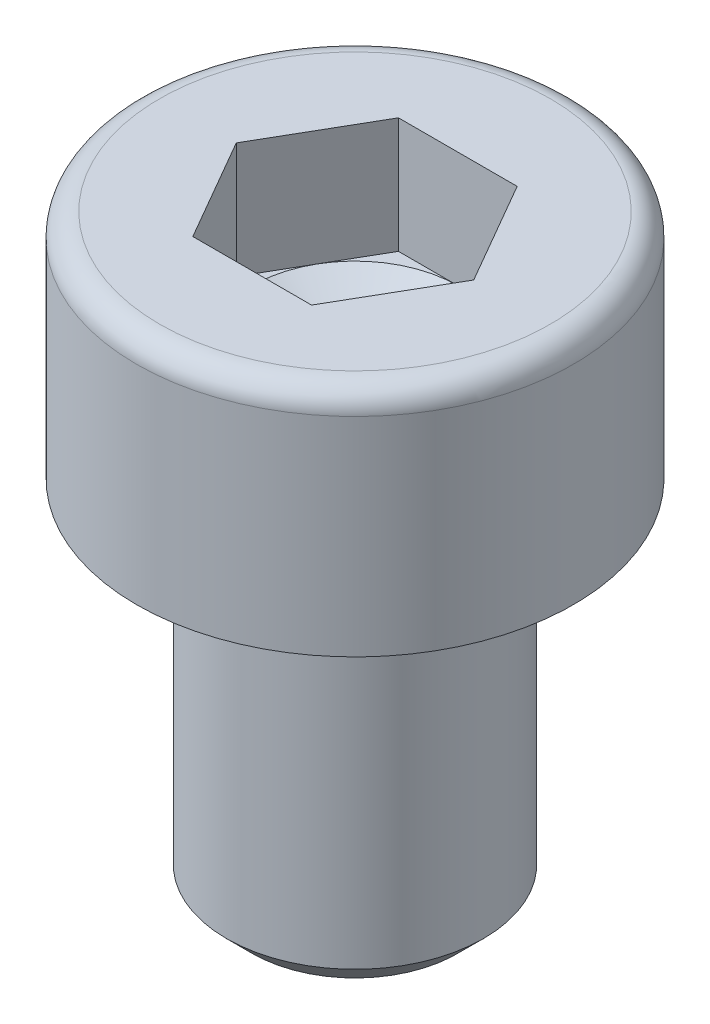
ISO-10303-21;
HEADER;
FILE_DESCRIPTION(('STEP AP214'),'2;1');
FILE_NAME('part.step','',(''),(''),'','','');
FILE_SCHEMA(('AUTOMOTIVE_DESIGN { 1 0 10303 214 1 1 1 1 }'));
ENDSEC;
DATA;
#1=APPLICATION_CONTEXT('core data for automotive mechanical design processes');
#2=APPLICATION_PROTOCOL_DEFINITION('international standard','automotive_design',2000,#1);
#3=PRODUCT_CONTEXT('',#1,'mechanical');
#4=PRODUCT('Part','Part','',(#3));
#5=PRODUCT_RELATED_PRODUCT_CATEGORY('part','',(#4));
#6=PRODUCT_DEFINITION_FORMATION('','',#4);
#7=PRODUCT_DEFINITION_CONTEXT('part definition',#1,'design');
#8=PRODUCT_DEFINITION('design','',#6,#7);
#9=PRODUCT_DEFINITION_SHAPE('','',#8);
#10=(LENGTH_UNIT() NAMED_UNIT(*) SI_UNIT(.MILLI.,.METRE.));
#11=(NAMED_UNIT(*) PLANE_ANGLE_UNIT() SI_UNIT($,.RADIAN.));
#12=(NAMED_UNIT(*) SI_UNIT($,.STERADIAN.) SOLID_ANGLE_UNIT());
#13=UNCERTAINTY_MEASURE_WITH_UNIT(LENGTH_MEASURE(1.E-05),#10,'distance_accuracy_value','');
#14=(GEOMETRIC_REPRESENTATION_CONTEXT(3) GLOBAL_UNCERTAINTY_ASSIGNED_CONTEXT((#13)) GLOBAL_UNIT_ASSIGNED_CONTEXT((#10,
#11,#12)) REPRESENTATION_CONTEXT('',''));
#15=CARTESIAN_POINT('',(0.,0.,0.));
#16=DIRECTION('',(0.,0.,1.));
#17=DIRECTION('',(1.,0.,0.));
#18=AXIS2_PLACEMENT_3D('',#15,#16,#17);
#19=CARTESIAN_POINT('',(0.,-7.,0.));
#20=DIRECTION('',(0.,1.,0.));
#21=DIRECTION('',(0.,0.,1.));
#22=AXIS2_PLACEMENT_3D('',#19,#20,#21);
#23=CYLINDRICAL_SURFACE('',#22,2.5);
#24=CARTESIAN_POINT('',(0.,-6.49999999999999,0.));
#25=DIRECTION('',(0.,1.,0.));
#26=DIRECTION('',(0.,0.,1.));
#27=AXIS2_PLACEMENT_3D('',#24,#25,#26);
#28=CIRCLE('',#27,2.5);
#29=CARTESIAN_POINT('',(0.,-6.49999999999999,2.5));
#30=VERTEX_POINT('',#29);
#31=EDGE_CURVE('E33',#30,#30,#28,.T.);
#32=ORIENTED_EDGE('',*,*,#31,.T.);
#33=EDGE_LOOP('',(#32));
#34=FACE_BOUND('',#33,.T.);
#35=CARTESIAN_POINT('',(0.,0.,0.));
#36=DIRECTION('',(0.,1.,0.));
#37=DIRECTION('',(0.,0.,1.));
#38=AXIS2_PLACEMENT_3D('',#35,#36,#37);
#39=CIRCLE('',#38,2.5);
#40=CARTESIAN_POINT('',(0.,0.,2.5));
#41=VERTEX_POINT('',#40);
#42=EDGE_CURVE('E144',#41,#41,#39,.T.);
#43=ORIENTED_EDGE('',*,*,#42,.F.);
#44=EDGE_LOOP('',(#43));
#45=FACE_BOUND('',#44,.T.);
#46=ADVANCED_FACE('F26',(#34,#45),#23,.T.);
#47=CARTESIAN_POINT('',(0.,-7.,0.));
#48=DIRECTION('',(0.,1.,0.));
#49=DIRECTION('',(0.,0.,1.));
#50=AXIS2_PLACEMENT_3D('',#47,#48,#49);
#51=PLANE('',#50);
#52=CARTESIAN_POINT('',(0.,-7.,0.));
#53=DIRECTION('',(0.,1.,0.));
#54=DIRECTION('',(0.,0.,1.));
#55=AXIS2_PLACEMENT_3D('',#52,#53,#54);
#56=CIRCLE('',#55,2.);
#57=CARTESIAN_POINT('',(0.,-7.,2.));
#58=VERTEX_POINT('',#57);
#59=EDGE_CURVE('E11',#58,#58,#56,.F.);
#60=ORIENTED_EDGE('',*,*,#59,.T.);
#61=EDGE_LOOP('',(#60));
#62=FACE_BOUND('',#61,.T.);
#63=ADVANCED_FACE('F154',(#62),#51,.F.);
#64=CARTESIAN_POINT('',(0.,-6.49999999999999,0.));
#65=DIRECTION('',(0.,1.,0.));
#66=DIRECTION('',(0.,0.,1.));
#67=AXIS2_PLACEMENT_3D('',#64,#65,#66);
#68=CONICAL_SURFACE('',#67,2.5,0.785398163397443);
#69=ORIENTED_EDGE('',*,*,#59,.F.);
#70=EDGE_LOOP('',(#69));
#71=FACE_BOUND('',#70,.T.);
#72=ORIENTED_EDGE('',*,*,#31,.F.);
#73=EDGE_LOOP('',(#72));
#74=FACE_BOUND('',#73,.T.);
#75=ADVANCED_FACE('F151',(#71,#74),#68,.T.);
#76=CARTESIAN_POINT('',(0.,0.,0.));
#77=DIRECTION('',(0.,1.,0.));
#78=DIRECTION('',(0.,0.,1.));
#79=AXIS2_PLACEMENT_3D('',#76,#77,#78);
#80=PLANE('',#79);
#81=ORIENTED_EDGE('',*,*,#42,.T.);
#82=EDGE_LOOP('',(#81));
#83=FACE_BOUND('',#82,.T.);
#84=CARTESIAN_POINT('',(0.,0.,0.));
#85=DIRECTION('',(0.,1.,0.));
#86=DIRECTION('',(0.,0.,1.));
#87=AXIS2_PLACEMENT_3D('',#84,#85,#86);
#88=CIRCLE('',#87,4.25);
#89=CARTESIAN_POINT('',(0.,0.,4.25));
#90=VERTEX_POINT('',#89);
#91=EDGE_CURVE('E141',#90,#90,#88,.T.);
#92=ORIENTED_EDGE('',*,*,#91,.F.);
#93=EDGE_LOOP('',(#92));
#94=FACE_BOUND('',#93,.T.);
#95=ADVANCED_FACE('F153',(#83,#94),#80,.F.);
#96=CARTESIAN_POINT('',(0.,4.5,0.));
#97=DIRECTION('',(0.,1.,0.));
#98=DIRECTION('',(0.,0.,1.));
#99=AXIS2_PLACEMENT_3D('',#96,#97,#98);
#100=CYLINDRICAL_SURFACE('',#99,4.25);
#101=CARTESIAN_POINT('',(0.,4.05,0.));
#102=DIRECTION('',(0.,1.,0.));
#103=DIRECTION('',(0.,0.,1.));
#104=AXIS2_PLACEMENT_3D('',#101,#102,#103);
#105=CIRCLE('',#104,4.25);
#106=CARTESIAN_POINT('',(0.,4.05,4.25));
#107=VERTEX_POINT('',#106);
#108=EDGE_CURVE('E138',#107,#107,#105,.T.);
#109=ORIENTED_EDGE('',*,*,#108,.F.);
#110=EDGE_LOOP('',(#109));
#111=FACE_BOUND('',#110,.T.);
#112=ORIENTED_EDGE('',*,*,#91,.T.);
#113=EDGE_LOOP('',(#112));
#114=FACE_BOUND('',#113,.T.);
#115=ADVANCED_FACE('F161',(#111,#114),#100,.T.);
#116=CARTESIAN_POINT('',(0.,4.05,0.));
#117=DIRECTION('',(0.,1.,0.));
#118=DIRECTION('',(0.,0.,1.));
#119=AXIS2_PLACEMENT_3D('',#116,#117,#118);
#120=TOROIDAL_SURFACE('',#119,3.8,0.449999999999999);
#121=CARTESIAN_POINT('',(0.,4.5,0.));
#122=DIRECTION('',(0.,1.,0.));
#123=DIRECTION('',(0.,0.,1.));
#124=AXIS2_PLACEMENT_3D('',#121,#122,#123);
#125=CIRCLE('',#124,3.8);
#126=CARTESIAN_POINT('',(0.,4.5,3.8));
#127=VERTEX_POINT('',#126);
#128=EDGE_CURVE('E133',#127,#127,#125,.T.);
#129=ORIENTED_EDGE('',*,*,#128,.F.);
#130=EDGE_LOOP('',(#129));
#131=FACE_BOUND('',#130,.T.);
#132=ORIENTED_EDGE('',*,*,#108,.T.);
#133=EDGE_LOOP('',(#132));
#134=FACE_BOUND('',#133,.T.);
#135=ADVANCED_FACE('F186',(#131,#134),#120,.T.);
#136=CARTESIAN_POINT('',(2.,4.5,0.));
#137=DIRECTION('',(0.,-1.,0.));
#138=DIRECTION('',(0.,0.,-1.));
#139=AXIS2_PLACEMENT_3D('',#136,#137,#138);
#140=PLANE('',#139);
#141=DIRECTION('',(-1.,0.,0.));
#142=VECTOR('',#141,1.);
#143=CARTESIAN_POINT('',(-1.15470053837925,4.5,-2.));
#144=LINE('',#143,#142);
#145=CARTESIAN_POINT('',(1.15470053837925,4.5,-2.));
#146=VERTEX_POINT('',#145);
#147=CARTESIAN_POINT('',(-1.15470053837925,4.5,-2.));
#148=VERTEX_POINT('',#147);
#149=EDGE_CURVE('E40',#146,#148,#144,.T.);
#150=ORIENTED_EDGE('',*,*,#149,.F.);
#151=DIRECTION('',(-0.499999999999998,0.,-0.86602540378444));
#152=VECTOR('',#151,1.);
#153=CARTESIAN_POINT('',(1.15470053837925,4.5,-2.));
#154=LINE('',#153,#152);
#155=CARTESIAN_POINT('',(2.3094010767585,4.5,0.));
#156=VERTEX_POINT('',#155);
#157=EDGE_CURVE('E117',#156,#146,#154,.T.);
#158=ORIENTED_EDGE('',*,*,#157,.F.);
#159=DIRECTION('',(0.499999999999997,0.,-0.86602540378444));
#160=VECTOR('',#159,1.);
#161=CARTESIAN_POINT('',(1.15470053837925,4.5,2.));
#162=LINE('',#161,#160);
#163=CARTESIAN_POINT('',(1.15470053837925,4.5,2.));
#164=VERTEX_POINT('',#163);
#165=EDGE_CURVE('E328',#164,#156,#162,.T.);
#166=ORIENTED_EDGE('',*,*,#165,.F.);
#167=DIRECTION('',(1.,0.,0.));
#168=VECTOR('',#167,1.);
#169=CARTESIAN_POINT('',(-1.15470053837925,4.5,2.));
#170=LINE('',#169,#168);
#171=CARTESIAN_POINT('',(-1.15470053837925,4.5,2.));
#172=VERTEX_POINT('',#171);
#173=EDGE_CURVE('E326',#172,#164,#170,.T.);
#174=ORIENTED_EDGE('',*,*,#173,.F.);
#175=DIRECTION('',(0.499999999999998,0.,0.86602540378444));
#176=VECTOR('',#175,1.);
#177=CARTESIAN_POINT('',(-1.15470053837925,4.5,2.));
#178=LINE('',#177,#176);
#179=CARTESIAN_POINT('',(-2.3094010767585,4.5,0.));
#180=VERTEX_POINT('',#179);
#181=EDGE_CURVE('E101',#180,#172,#178,.T.);
#182=ORIENTED_EDGE('',*,*,#181,.F.);
#183=DIRECTION('',(-0.499999999999998,0.,0.86602540378444));
#184=VECTOR('',#183,1.);
#185=CARTESIAN_POINT('',(-1.15470053837925,4.5,-2.));
#186=LINE('',#185,#184);
#187=EDGE_CURVE('E97',#148,#180,#186,.T.);
#188=ORIENTED_EDGE('',*,*,#187,.F.);
#189=EDGE_LOOP('',(#150,#158,#166,#174,#182,#188));
#190=FACE_BOUND('',#189,.T.);
#191=ORIENTED_EDGE('',*,*,#128,.T.);
#192=EDGE_LOOP('',(#191));
#193=FACE_BOUND('',#192,.T.);
#194=ADVANCED_FACE('F98',(#190,#193),#140,.F.);
#195=CARTESIAN_POINT('',(1.15470053837925,2.25,-2.));
#196=DIRECTION('',(0.86602540378444,0.,-0.499999999999998));
#197=DIRECTION('',(-0.499999999999998,0.,-0.86602540378444));
#198=AXIS2_PLACEMENT_3D('',#195,#196,#197);
#199=PLANE('',#198);
#200=ORIENTED_EDGE('',*,*,#157,.T.);
#201=DIRECTION('',(0.,1.,0.));
#202=VECTOR('',#201,1.);
#203=CARTESIAN_POINT('',(1.15470053837925,2.25,-2.));
#204=LINE('',#203,#202);
#205=CARTESIAN_POINT('',(1.15470053837925,2.25,-2.));
#206=VERTEX_POINT('',#205);
#207=EDGE_CURVE('E115',#206,#146,#204,.T.);
#208=ORIENTED_EDGE('',*,*,#207,.F.);
#209=DIRECTION('',(-0.499999999999998,0.,-0.86602540378444));
#210=VECTOR('',#209,1.);
#211=CARTESIAN_POINT('',(1.15470053837925,2.25,-2.));
#212=LINE('',#211,#210);
#213=CARTESIAN_POINT('',(1.73205080756888,2.25,-0.999999999999995));
#214=VERTEX_POINT('',#213);
#215=EDGE_CURVE('E330',#214,#206,#212,.T.);
#216=ORIENTED_EDGE('',*,*,#215,.F.);
#217=CARTESIAN_POINT('',(2.3094010767585,2.25,0.));
#218=VERTEX_POINT('',#217);
#219=EDGE_CURVE('E334',#218,#214,#212,.T.);
#220=ORIENTED_EDGE('',*,*,#219,.F.);
#221=DIRECTION('',(0.,1.,0.));
#222=VECTOR('',#221,1.);
#223=CARTESIAN_POINT('',(2.3094010767585,2.25,0.));
#224=LINE('',#223,#222);
#225=EDGE_CURVE('E318',#218,#156,#224,.T.);
#226=ORIENTED_EDGE('',*,*,#225,.T.);
#227=EDGE_LOOP('',(#200,#208,#216,#220,#226));
#228=FACE_BOUND('',#227,.T.);
#229=ADVANCED_FACE('F201',(#228),#199,.F.);
#230=CARTESIAN_POINT('',(1.15470053837925,2.25,2.));
#231=DIRECTION('',(0.86602540378444,0.,0.499999999999997));
#232=DIRECTION('',(0.499999999999998,0.,-0.86602540378444));
#233=AXIS2_PLACEMENT_3D('',#230,#231,#232);
#234=PLANE('',#233);
#235=ORIENTED_EDGE('',*,*,#165,.T.);
#236=ORIENTED_EDGE('',*,*,#225,.F.);
#237=DIRECTION('',(0.499999999999997,0.,-0.86602540378444));
#238=VECTOR('',#237,1.);
#239=CARTESIAN_POINT('',(1.15470053837925,2.25,2.));
#240=LINE('',#239,#238);
#241=CARTESIAN_POINT('',(1.73205080756888,2.25,0.999999999999995));
#242=VERTEX_POINT('',#241);
#243=EDGE_CURVE('E314',#242,#218,#240,.T.);
#244=ORIENTED_EDGE('',*,*,#243,.F.);
#245=CARTESIAN_POINT('',(1.15470053837925,2.25,2.));
#246=VERTEX_POINT('',#245);
#247=EDGE_CURVE('E48',#246,#242,#240,.T.);
#248=ORIENTED_EDGE('',*,*,#247,.F.);
#249=DIRECTION('',(0.,1.,0.));
#250=VECTOR('',#249,1.);
#251=CARTESIAN_POINT('',(1.15470053837925,2.25,2.));
#252=LINE('',#251,#250);
#253=EDGE_CURVE('E308',#246,#164,#252,.T.);
#254=ORIENTED_EDGE('',*,*,#253,.T.);
#255=EDGE_LOOP('',(#235,#236,#244,#248,#254));
#256=FACE_BOUND('',#255,.T.);
#257=ADVANCED_FACE('F218',(#256),#234,.F.);
#258=CARTESIAN_POINT('',(-1.15470053837925,2.25,2.));
#259=DIRECTION('',(0.,0.,1.));
#260=DIRECTION('',(1.,0.,0.));
#261=AXIS2_PLACEMENT_3D('',#258,#259,#260);
#262=PLANE('',#261);
#263=ORIENTED_EDGE('',*,*,#173,.T.);
#264=ORIENTED_EDGE('',*,*,#253,.F.);
#265=DIRECTION('',(1.,0.,0.));
#266=VECTOR('',#265,1.);
#267=CARTESIAN_POINT('',(-1.15470053837925,2.25,2.));
#268=LINE('',#267,#266);
#269=CARTESIAN_POINT('',(0.,2.25,2.));
#270=VERTEX_POINT('',#269);
#271=EDGE_CURVE('E297',#270,#246,#268,.T.);
#272=ORIENTED_EDGE('',*,*,#271,.F.);
#273=CARTESIAN_POINT('',(-1.15470053837925,2.25,2.));
#274=VERTEX_POINT('',#273);
#275=EDGE_CURVE('E306',#274,#270,#268,.T.);
#276=ORIENTED_EDGE('',*,*,#275,.F.);
#277=DIRECTION('',(0.,1.,0.));
#278=VECTOR('',#277,1.);
#279=CARTESIAN_POINT('',(-1.15470053837925,2.25,2.));
#280=LINE('',#279,#278);
#281=EDGE_CURVE('E125',#274,#172,#280,.T.);
#282=ORIENTED_EDGE('',*,*,#281,.T.);
#283=EDGE_LOOP('',(#263,#264,#272,#276,#282));
#284=FACE_BOUND('',#283,.T.);
#285=ADVANCED_FACE('F226',(#284),#262,.F.);
#286=CARTESIAN_POINT('',(-1.15470053837925,2.25,2.));
#287=DIRECTION('',(-0.86602540378444,0.,0.499999999999998));
#288=DIRECTION('',(0.499999999999998,0.,0.86602540378444));
#289=AXIS2_PLACEMENT_3D('',#286,#287,#288);
#290=PLANE('',#289);
#291=ORIENTED_EDGE('',*,*,#181,.T.);
#292=ORIENTED_EDGE('',*,*,#281,.F.);
#293=DIRECTION('',(0.499999999999998,0.,0.86602540378444));
#294=VECTOR('',#293,1.);
#295=CARTESIAN_POINT('',(-1.15470053837925,2.25,2.));
#296=LINE('',#295,#294);
#297=CARTESIAN_POINT('',(-1.73205080756888,2.25,0.999999999999995));
#298=VERTEX_POINT('',#297);
#299=EDGE_CURVE('E312',#298,#274,#296,.T.);
#300=ORIENTED_EDGE('',*,*,#299,.F.);
#301=CARTESIAN_POINT('',(-2.3094010767585,2.25,0.));
#302=VERTEX_POINT('',#301);
#303=EDGE_CURVE('E309',#302,#298,#296,.T.);
#304=ORIENTED_EDGE('',*,*,#303,.F.);
#305=DIRECTION('',(0.,1.,0.));
#306=VECTOR('',#305,1.);
#307=CARTESIAN_POINT('',(-2.3094010767585,2.25,0.));
#308=LINE('',#307,#306);
#309=EDGE_CURVE('E123',#302,#180,#308,.T.);
#310=ORIENTED_EDGE('',*,*,#309,.T.);
#311=EDGE_LOOP('',(#291,#292,#300,#304,#310));
#312=FACE_BOUND('',#311,.T.);
#313=ADVANCED_FACE('F234',(#312),#290,.F.);
#314=CARTESIAN_POINT('',(-1.15470053837925,2.25,-2.));
#315=DIRECTION('',(-0.86602540378444,0.,-0.499999999999998));
#316=DIRECTION('',(-0.499999999999998,0.,0.86602540378444));
#317=AXIS2_PLACEMENT_3D('',#314,#315,#316);
#318=PLANE('',#317);
#319=ORIENTED_EDGE('',*,*,#187,.T.);
#320=ORIENTED_EDGE('',*,*,#309,.F.);
#321=DIRECTION('',(-0.499999999999998,0.,0.86602540378444));
#322=VECTOR('',#321,1.);
#323=CARTESIAN_POINT('',(-1.15470053837925,2.25,-2.));
#324=LINE('',#323,#322);
#325=CARTESIAN_POINT('',(-1.73205080756888,2.25,-0.999999999999995));
#326=VERTEX_POINT('',#325);
#327=EDGE_CURVE('E341',#326,#302,#324,.T.);
#328=ORIENTED_EDGE('',*,*,#327,.F.);
#329=CARTESIAN_POINT('',(-1.15470053837925,2.25,-2.));
#330=VERTEX_POINT('',#329);
#331=EDGE_CURVE('E122',#330,#326,#324,.T.);
#332=ORIENTED_EDGE('',*,*,#331,.F.);
#333=DIRECTION('',(0.,1.,0.));
#334=VECTOR('',#333,1.);
#335=CARTESIAN_POINT('',(-1.15470053837925,2.25,-2.));
#336=LINE('',#335,#334);
#337=EDGE_CURVE('E111',#330,#148,#336,.T.);
#338=ORIENTED_EDGE('',*,*,#337,.T.);
#339=EDGE_LOOP('',(#319,#320,#328,#332,#338));
#340=FACE_BOUND('',#339,.T.);
#341=ADVANCED_FACE('F119',(#340),#318,.F.);
#342=CARTESIAN_POINT('',(-1.15470053837925,2.25,-2.));
#343=DIRECTION('',(0.,0.,-1.));
#344=DIRECTION('',(-1.,0.,0.));
#345=AXIS2_PLACEMENT_3D('',#342,#343,#344);
#346=PLANE('',#345);
#347=ORIENTED_EDGE('',*,*,#149,.T.);
#348=ORIENTED_EDGE('',*,*,#337,.F.);
#349=DIRECTION('',(-1.,0.,0.));
#350=VECTOR('',#349,1.);
#351=CARTESIAN_POINT('',(-1.15470053837925,2.25,-2.));
#352=LINE('',#351,#350);
#353=CARTESIAN_POINT('',(0.,2.25,-2.));
#354=VERTEX_POINT('',#353);
#355=EDGE_CURVE('E337',#354,#330,#352,.T.);
#356=ORIENTED_EDGE('',*,*,#355,.F.);
#357=EDGE_CURVE('E338',#206,#354,#352,.T.);
#358=ORIENTED_EDGE('',*,*,#357,.F.);
#359=ORIENTED_EDGE('',*,*,#207,.T.);
#360=EDGE_LOOP('',(#347,#348,#356,#358,#359));
#361=FACE_BOUND('',#360,.T.);
#362=ADVANCED_FACE('F109',(#361),#346,.F.);
#363=CARTESIAN_POINT('',(3.46410161513774,2.25,2.));
#364=DIRECTION('',(0.,1.,0.));
#365=DIRECTION('',(0.,0.,1.));
#366=AXIS2_PLACEMENT_3D('',#363,#364,#365);
#367=PLANE('',#366);
#368=CARTESIAN_POINT('',(0.,2.25,0.));
#369=DIRECTION('',(0.,1.,0.));
#370=DIRECTION('',(0.,0.,1.));
#371=AXIS2_PLACEMENT_3D('',#368,#369,#370);
#372=CIRCLE('',#371,2.);
#373=EDGE_CURVE('E135',#298,#270,#372,.T.);
#374=ORIENTED_EDGE('',*,*,#373,.F.);
#375=ORIENTED_EDGE('',*,*,#299,.T.);
#376=ORIENTED_EDGE('',*,*,#275,.T.);
#377=EDGE_LOOP('',(#374,#375,#376));
#378=FACE_BOUND('',#377,.T.);
#379=ADVANCED_FACE('F255',(#378),#367,.T.);
#380=EDGE_CURVE('E317',#326,#298,#372,.T.);
#381=ORIENTED_EDGE('',*,*,#380,.F.);
#382=ORIENTED_EDGE('',*,*,#327,.T.);
#383=ORIENTED_EDGE('',*,*,#303,.T.);
#384=EDGE_LOOP('',(#381,#382,#383));
#385=FACE_BOUND('',#384,.T.);
#386=ADVANCED_FACE('F262',(#385),#367,.T.);
#387=EDGE_CURVE('E319',#354,#326,#372,.T.);
#388=ORIENTED_EDGE('',*,*,#387,.F.);
#389=ORIENTED_EDGE('',*,*,#355,.T.);
#390=ORIENTED_EDGE('',*,*,#331,.T.);
#391=EDGE_LOOP('',(#388,#389,#390));
#392=FACE_BOUND('',#391,.T.);
#393=ADVANCED_FACE('F270',(#392),#367,.T.);
#394=EDGE_CURVE('E346',#214,#354,#372,.T.);
#395=ORIENTED_EDGE('',*,*,#394,.F.);
#396=ORIENTED_EDGE('',*,*,#215,.T.);
#397=ORIENTED_EDGE('',*,*,#357,.T.);
#398=EDGE_LOOP('',(#395,#396,#397));
#399=FACE_BOUND('',#398,.T.);
#400=ADVANCED_FACE('F277',(#399),#367,.T.);
#401=EDGE_CURVE('E134',#242,#214,#372,.T.);
#402=ORIENTED_EDGE('',*,*,#401,.F.);
#403=ORIENTED_EDGE('',*,*,#243,.T.);
#404=ORIENTED_EDGE('',*,*,#219,.T.);
#405=EDGE_LOOP('',(#402,#403,#404));
#406=FACE_BOUND('',#405,.T.);
#407=ADVANCED_FACE('F284',(#406),#367,.T.);
#408=EDGE_CURVE('E130',#270,#242,#372,.T.);
#409=ORIENTED_EDGE('',*,*,#408,.F.);
#410=ORIENTED_EDGE('',*,*,#271,.T.);
#411=ORIENTED_EDGE('',*,*,#247,.T.);
#412=EDGE_LOOP('',(#409,#410,#411));
#413=FACE_BOUND('',#412,.T.);
#414=ADVANCED_FACE('F210',(#413),#367,.T.);
#415=CARTESIAN_POINT('',(0.,2.25,0.));
#416=DIRECTION('',(0.,1.,0.));
#417=DIRECTION('',(0.,0.,1.));
#418=AXIS2_PLACEMENT_3D('',#415,#416,#417);
#419=CONICAL_SURFACE('',#418,2.,1.04719755119659);
#420=CARTESIAN_POINT('',(0.,1.09529946162073,0.));
#421=VERTEX_POINT('',#420);
#422=VERTEX_LOOP('',#421);
#423=FACE_BOUND('',#422,.T.);
#424=ORIENTED_EDGE('',*,*,#408,.T.);
#425=ORIENTED_EDGE('',*,*,#401,.T.);
#426=ORIENTED_EDGE('',*,*,#394,.T.);
#427=ORIENTED_EDGE('',*,*,#387,.T.);
#428=ORIENTED_EDGE('',*,*,#380,.T.);
#429=ORIENTED_EDGE('',*,*,#373,.T.);
#430=EDGE_LOOP('',(#424,#425,#426,#427,#428,#429));
#431=FACE_BOUND('',#430,.T.);
#432=ADVANCED_FACE('F205',(#423,#431),#419,.F.);
#433=CLOSED_SHELL('',(#46,#63,#75,#95,#115,#135,#194,#229,#257,#285,#313,#341,#362,#379,#386,
#393,#400,#407,#414,#432));
#434=MANIFOLD_SOLID_BREP('B2',#433);
#435=ADVANCED_BREP_SHAPE_REPRESENTATION('',(#18,#434),#14);
#436=SHAPE_DEFINITION_REPRESENTATION(#9,#435);
ENDSEC;
END-ISO-10303-21;
